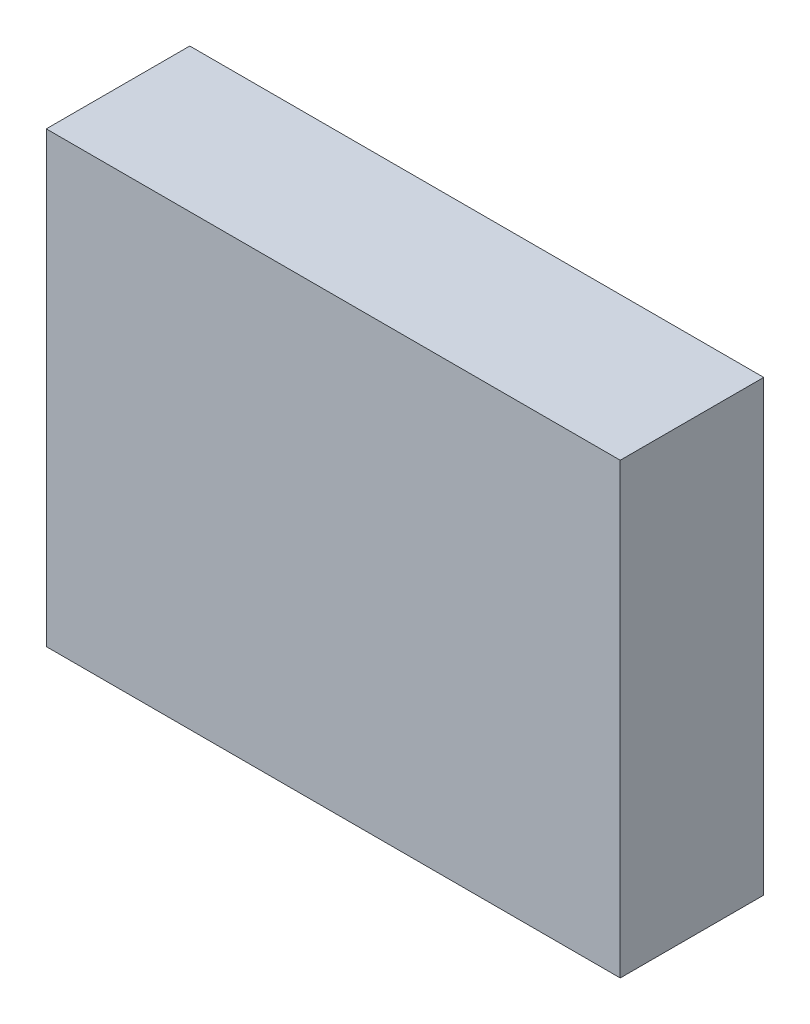
ISO-10303-21;
HEADER;
FILE_DESCRIPTION(('STEP AP214'),'2;1');
FILE_NAME('part.step','',(''),(''),'','','');
FILE_SCHEMA(('AUTOMOTIVE_DESIGN { 1 0 10303 214 1 1 1 1 }'));
ENDSEC;
DATA;
#1=APPLICATION_CONTEXT('core data for automotive mechanical design processes');
#2=APPLICATION_PROTOCOL_DEFINITION('international standard','automotive_design',2000,#1);
#3=PRODUCT_CONTEXT('',#1,'mechanical');
#4=PRODUCT('Part','Part','',(#3));
#5=PRODUCT_RELATED_PRODUCT_CATEGORY('part','',(#4));
#6=PRODUCT_DEFINITION_FORMATION('','',#4);
#7=PRODUCT_DEFINITION_CONTEXT('part definition',#1,'design');
#8=PRODUCT_DEFINITION('design','',#6,#7);
#9=PRODUCT_DEFINITION_SHAPE('','',#8);
#10=(LENGTH_UNIT() NAMED_UNIT(*) SI_UNIT(.MILLI.,.METRE.));
#11=(NAMED_UNIT(*) PLANE_ANGLE_UNIT() SI_UNIT($,.RADIAN.));
#12=(NAMED_UNIT(*) SI_UNIT($,.STERADIAN.) SOLID_ANGLE_UNIT());
#13=UNCERTAINTY_MEASURE_WITH_UNIT(LENGTH_MEASURE(1.E-05),#10,'distance_accuracy_value','');
#14=(GEOMETRIC_REPRESENTATION_CONTEXT(3) GLOBAL_UNCERTAINTY_ASSIGNED_CONTEXT((#13)) GLOBAL_UNIT_ASSIGNED_CONTEXT((#10,
#11,#12)) REPRESENTATION_CONTEXT('',''));
#15=CARTESIAN_POINT('',(0.,0.,0.));
#16=DIRECTION('',(0.,0.,1.));
#17=DIRECTION('',(1.,0.,0.));
#18=AXIS2_PLACEMENT_3D('',#15,#16,#17);
#19=CARTESIAN_POINT('',(-1.59999934,-1.25000004,0.80000094));
#20=DIRECTION('',(0.,0.,-1.));
#21=DIRECTION('',(-1.,0.,0.));
#22=AXIS2_PLACEMENT_3D('',#19,#20,#21);
#23=PLANE('',#22);
#24=DIRECTION('',(0.,1.,0.));
#25=VECTOR('',#24,1.);
#26=CARTESIAN_POINT('',(1.59999934,-1.25000004,0.80000094));
#27=LINE('',#26,#25);
#28=CARTESIAN_POINT('',(1.59999934,-1.25000004,0.80000094));
#29=VERTEX_POINT('',#28);
#30=CARTESIAN_POINT('',(1.59999934,1.25000004,0.80000094));
#31=VERTEX_POINT('',#30);
#32=EDGE_CURVE('E54',#29,#31,#27,.T.);
#33=ORIENTED_EDGE('',*,*,#32,.T.);
#34=DIRECTION('',(1.,0.,0.));
#35=VECTOR('',#34,1.);
#36=CARTESIAN_POINT('',(1.59999934,1.25000004,0.80000094));
#37=LINE('',#36,#35);
#38=CARTESIAN_POINT('',(-1.59999934,1.25000004,0.80000094));
#39=VERTEX_POINT('',#38);
#40=EDGE_CURVE('E56',#31,#39,#37,.F.);
#41=ORIENTED_EDGE('',*,*,#40,.T.);
#42=DIRECTION('',(0.,1.,0.));
#43=VECTOR('',#42,1.);
#44=CARTESIAN_POINT('',(-1.59999934,1.25000004,0.80000094));
#45=LINE('',#44,#43);
#46=CARTESIAN_POINT('',(-1.59999934,-1.25000004,0.80000094));
#47=VERTEX_POINT('',#46);
#48=EDGE_CURVE('E19',#39,#47,#45,.F.);
#49=ORIENTED_EDGE('',*,*,#48,.T.);
#50=DIRECTION('',(1.,0.,0.));
#51=VECTOR('',#50,1.);
#52=CARTESIAN_POINT('',(-1.59999934,-1.25000004,0.80000094));
#53=LINE('',#52,#51);
#54=EDGE_CURVE('E79',#47,#29,#53,.T.);
#55=ORIENTED_EDGE('',*,*,#54,.T.);
#56=EDGE_LOOP('',(#33,#41,#49,#55));
#57=FACE_BOUND('',#56,.T.);
#58=ADVANCED_FACE('F16',(#57),#23,.F.);
#59=CARTESIAN_POINT('',(-1.59999934,1.25000004,0.));
#60=DIRECTION('',(1.,0.,0.));
#61=DIRECTION('',(0.,0.,-1.));
#62=AXIS2_PLACEMENT_3D('',#59,#60,#61);
#63=PLANE('',#62);
#64=DIRECTION('',(0.,0.,1.));
#65=VECTOR('',#64,1.);
#66=CARTESIAN_POINT('',(-1.59999934,-1.25000004,0.));
#67=LINE('',#66,#65);
#68=CARTESIAN_POINT('',(-1.59999934,-1.25000004,0.));
#69=VERTEX_POINT('',#68);
#70=EDGE_CURVE('E67',#69,#47,#67,.T.);
#71=ORIENTED_EDGE('',*,*,#70,.T.);
#72=ORIENTED_EDGE('',*,*,#48,.F.);
#73=DIRECTION('',(0.,0.,-1.));
#74=VECTOR('',#73,1.);
#75=CARTESIAN_POINT('',(-1.59999934,1.25000004,0.));
#76=LINE('',#75,#74);
#77=CARTESIAN_POINT('',(-1.59999934,1.25000004,0.));
#78=VERTEX_POINT('',#77);
#79=EDGE_CURVE('E62',#39,#78,#76,.T.);
#80=ORIENTED_EDGE('',*,*,#79,.T.);
#81=DIRECTION('',(0.,1.,0.));
#82=VECTOR('',#81,1.);
#83=CARTESIAN_POINT('',(-1.59999934,-1.25000004,0.));
#84=LINE('',#83,#82);
#85=EDGE_CURVE('E82',#69,#78,#84,.T.);
#86=ORIENTED_EDGE('',*,*,#85,.F.);
#87=EDGE_LOOP('',(#71,#72,#80,#86));
#88=FACE_BOUND('',#87,.T.);
#89=ADVANCED_FACE('F64',(#88),#63,.F.);
#90=CARTESIAN_POINT('',(1.59999934,1.25000004,0.));
#91=DIRECTION('',(0.,-1.,0.));
#92=DIRECTION('',(0.,0.,-1.));
#93=AXIS2_PLACEMENT_3D('',#90,#91,#92);
#94=PLANE('',#93);
#95=ORIENTED_EDGE('',*,*,#79,.F.);
#96=ORIENTED_EDGE('',*,*,#40,.F.);
#97=DIRECTION('',(0.,0.,1.));
#98=VECTOR('',#97,1.);
#99=CARTESIAN_POINT('',(1.59999934,1.25000004,0.));
#100=LINE('',#99,#98);
#101=CARTESIAN_POINT('',(1.59999934,1.25000004,0.));
#102=VERTEX_POINT('',#101);
#103=EDGE_CURVE('E74',#31,#102,#100,.F.);
#104=ORIENTED_EDGE('',*,*,#103,.T.);
#105=DIRECTION('',(-1.,0.,0.));
#106=VECTOR('',#105,1.);
#107=CARTESIAN_POINT('',(-1.59999934,1.25000004,0.));
#108=LINE('',#107,#106);
#109=EDGE_CURVE('E71',#78,#102,#108,.F.);
#110=ORIENTED_EDGE('',*,*,#109,.F.);
#111=EDGE_LOOP('',(#95,#96,#104,#110));
#112=FACE_BOUND('',#111,.T.);
#113=ADVANCED_FACE('F69',(#112),#94,.F.);
#114=CARTESIAN_POINT('',(1.59999934,-1.25000004,0.));
#115=DIRECTION('',(-1.,0.,0.));
#116=DIRECTION('',(0.,0.,1.));
#117=AXIS2_PLACEMENT_3D('',#114,#115,#116);
#118=PLANE('',#117);
#119=ORIENTED_EDGE('',*,*,#103,.F.);
#120=ORIENTED_EDGE('',*,*,#32,.F.);
#121=DIRECTION('',(0.,0.,1.));
#122=VECTOR('',#121,1.);
#123=CARTESIAN_POINT('',(1.59999934,-1.25000004,0.));
#124=LINE('',#123,#122);
#125=CARTESIAN_POINT('',(1.59999934,-1.25000004,0.));
#126=VERTEX_POINT('',#125);
#127=EDGE_CURVE('E34',#29,#126,#124,.F.);
#128=ORIENTED_EDGE('',*,*,#127,.T.);
#129=DIRECTION('',(0.,1.,0.));
#130=VECTOR('',#129,1.);
#131=CARTESIAN_POINT('',(1.59999934,-1.25000004,0.));
#132=LINE('',#131,#130);
#133=EDGE_CURVE('E25',#102,#126,#132,.F.);
#134=ORIENTED_EDGE('',*,*,#133,.F.);
#135=EDGE_LOOP('',(#119,#120,#128,#134));
#136=FACE_BOUND('',#135,.T.);
#137=ADVANCED_FACE('F88',(#136),#118,.F.);
#138=CARTESIAN_POINT('',(-1.59999934,-1.25000004,0.));
#139=DIRECTION('',(0.,1.,0.));
#140=DIRECTION('',(0.,0.,1.));
#141=AXIS2_PLACEMENT_3D('',#138,#139,#140);
#142=PLANE('',#141);
#143=ORIENTED_EDGE('',*,*,#127,.F.);
#144=ORIENTED_EDGE('',*,*,#54,.F.);
#145=ORIENTED_EDGE('',*,*,#70,.F.);
#146=DIRECTION('',(-1.,0.,0.));
#147=VECTOR('',#146,1.);
#148=CARTESIAN_POINT('',(-1.59999934,-1.25000004,0.));
#149=LINE('',#148,#147);
#150=EDGE_CURVE('E11',#126,#69,#149,.T.);
#151=ORIENTED_EDGE('',*,*,#150,.F.);
#152=EDGE_LOOP('',(#143,#144,#145,#151));
#153=FACE_BOUND('',#152,.T.);
#154=ADVANCED_FACE('F90',(#153),#142,.F.);
#155=CARTESIAN_POINT('',(-1.59999934,-1.25000004,0.));
#156=DIRECTION('',(0.,0.,-1.));
#157=DIRECTION('',(-1.,0.,0.));
#158=AXIS2_PLACEMENT_3D('',#155,#156,#157);
#159=PLANE('',#158);
#160=ORIENTED_EDGE('',*,*,#133,.T.);
#161=ORIENTED_EDGE('',*,*,#150,.T.);
#162=ORIENTED_EDGE('',*,*,#85,.T.);
#163=ORIENTED_EDGE('',*,*,#109,.T.);
#164=EDGE_LOOP('',(#160,#161,#162,#163));
#165=FACE_BOUND('',#164,.T.);
#166=ADVANCED_FACE('F87',(#165),#159,.T.);
#167=CLOSED_SHELL('',(#58,#89,#113,#137,#154,#166));
#168=MANIFOLD_SOLID_BREP('B1',#167);
#169=ADVANCED_BREP_SHAPE_REPRESENTATION('',(#18,#168),#14);
#170=SHAPE_DEFINITION_REPRESENTATION(#9,#169);
ENDSEC;
END-ISO-10303-21;
